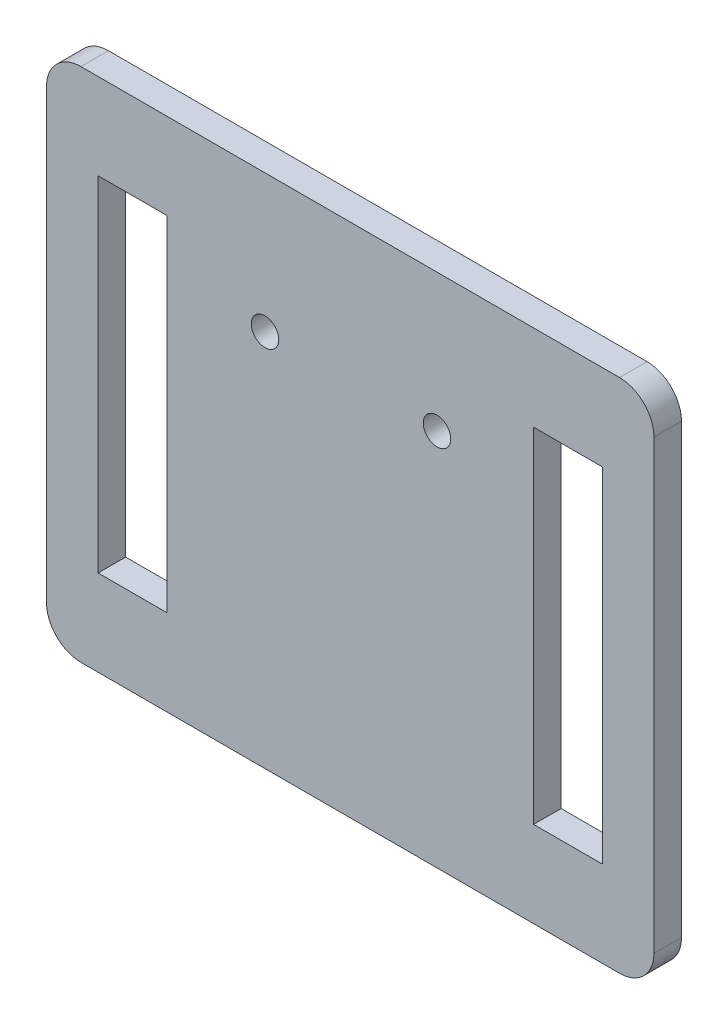
ISO-10303-21;
HEADER;
FILE_DESCRIPTION(('STEP AP214'),'2;1');
FILE_NAME('part.step','',(''),(''),'','','');
FILE_SCHEMA(('AUTOMOTIVE_DESIGN { 1 0 10303 214 1 1 1 1 }'));
ENDSEC;
DATA;
#1=APPLICATION_CONTEXT('core data for automotive mechanical design processes');
#2=APPLICATION_PROTOCOL_DEFINITION('international standard','automotive_design',2000,#1);
#3=PRODUCT_CONTEXT('',#1,'mechanical');
#4=PRODUCT('Part','Part','',(#3));
#5=PRODUCT_RELATED_PRODUCT_CATEGORY('part','',(#4));
#6=PRODUCT_DEFINITION_FORMATION('','',#4);
#7=PRODUCT_DEFINITION_CONTEXT('part definition',#1,'design');
#8=PRODUCT_DEFINITION('design','',#6,#7);
#9=PRODUCT_DEFINITION_SHAPE('','',#8);
#10=(LENGTH_UNIT() NAMED_UNIT(*) SI_UNIT(.MILLI.,.METRE.));
#11=(NAMED_UNIT(*) PLANE_ANGLE_UNIT() SI_UNIT($,.RADIAN.));
#12=(NAMED_UNIT(*) SI_UNIT($,.STERADIAN.) SOLID_ANGLE_UNIT());
#13=UNCERTAINTY_MEASURE_WITH_UNIT(LENGTH_MEASURE(1.E-05),#10,'distance_accuracy_value','');
#14=(GEOMETRIC_REPRESENTATION_CONTEXT(3) GLOBAL_UNCERTAINTY_ASSIGNED_CONTEXT((#13)) GLOBAL_UNIT_ASSIGNED_CONTEXT((#10,
#11,#12)) REPRESENTATION_CONTEXT('',''));
#15=CARTESIAN_POINT('',(0.,0.,0.));
#16=DIRECTION('',(0.,0.,1.));
#17=DIRECTION('',(1.,0.,0.));
#18=AXIS2_PLACEMENT_3D('',#15,#16,#17);
#19=CARTESIAN_POINT('',(0.,6.50000000000001,1.6));
#20=DIRECTION('',(0.,1.,0.));
#21=DIRECTION('',(-1.,0.,0.));
#22=AXIS2_PLACEMENT_3D('',#19,#20,#21);
#23=PLANE('',#22);
#24=DIRECTION('',(1.,0.,0.));
#25=VECTOR('',#24,1.);
#26=CARTESIAN_POINT('',(0.,6.50000000000001,0.));
#27=LINE('',#26,#25);
#28=CARTESIAN_POINT('',(30.,6.5,0.));
#29=VERTEX_POINT('',#28);
#30=CARTESIAN_POINT('',(34.,6.5,0.));
#31=VERTEX_POINT('',#30);
#32=EDGE_CURVE('E239',#29,#31,#27,.T.);
#33=ORIENTED_EDGE('',*,*,#32,.T.);
#34=DIRECTION('',(0.,0.,-1.));
#35=VECTOR('',#34,1.);
#36=CARTESIAN_POINT('',(34.,6.5,1.6));
#37=LINE('',#36,#35);
#38=CARTESIAN_POINT('',(34.,6.5,1.6));
#39=VERTEX_POINT('',#38);
#40=EDGE_CURVE('E185',#39,#31,#37,.T.);
#41=ORIENTED_EDGE('',*,*,#40,.F.);
#42=DIRECTION('',(1.,0.,0.));
#43=VECTOR('',#42,1.);
#44=CARTESIAN_POINT('',(0.,6.50000000000001,1.6));
#45=LINE('',#44,#43);
#46=CARTESIAN_POINT('',(30.,6.5,1.6));
#47=VERTEX_POINT('',#46);
#48=EDGE_CURVE('E290',#47,#39,#45,.T.);
#49=ORIENTED_EDGE('',*,*,#48,.F.);
#50=DIRECTION('',(0.,0.,-1.));
#51=VECTOR('',#50,1.);
#52=CARTESIAN_POINT('',(30.,6.5,1.6));
#53=LINE('',#52,#51);
#54=EDGE_CURVE('E174',#47,#29,#53,.T.);
#55=ORIENTED_EDGE('',*,*,#54,.T.);
#56=EDGE_LOOP('',(#33,#41,#49,#55));
#57=FACE_BOUND('',#56,.T.);
#58=ADVANCED_FACE('F35',(#57),#23,.F.);
#59=CARTESIAN_POINT('',(34.,0.,1.6));
#60=DIRECTION('',(1.,0.,0.));
#61=DIRECTION('',(0.,0.,-1.));
#62=AXIS2_PLACEMENT_3D('',#59,#60,#61);
#63=PLANE('',#62);
#64=DIRECTION('',(0.,-1.,0.));
#65=VECTOR('',#64,1.);
#66=CARTESIAN_POINT('',(34.,0.,0.));
#67=LINE('',#66,#65);
#68=CARTESIAN_POINT('',(34.,-13.5,0.));
#69=VERTEX_POINT('',#68);
#70=EDGE_CURVE('E242',#31,#69,#67,.T.);
#71=ORIENTED_EDGE('',*,*,#70,.T.);
#72=DIRECTION('',(0.,0.,-1.));
#73=VECTOR('',#72,1.);
#74=CARTESIAN_POINT('',(34.,-13.5,1.6));
#75=LINE('',#74,#73);
#76=CARTESIAN_POINT('',(34.,-13.5,1.6));
#77=VERTEX_POINT('',#76);
#78=EDGE_CURVE('E253',#77,#69,#75,.T.);
#79=ORIENTED_EDGE('',*,*,#78,.F.);
#80=DIRECTION('',(0.,-1.,0.));
#81=VECTOR('',#80,1.);
#82=CARTESIAN_POINT('',(34.,0.,1.6));
#83=LINE('',#82,#81);
#84=EDGE_CURVE('E288',#39,#77,#83,.T.);
#85=ORIENTED_EDGE('',*,*,#84,.F.);
#86=ORIENTED_EDGE('',*,*,#40,.T.);
#87=EDGE_LOOP('',(#71,#79,#85,#86));
#88=FACE_BOUND('',#87,.T.);
#89=ADVANCED_FACE('F287',(#88),#63,.F.);
#90=CARTESIAN_POINT('',(0.,-13.5,1.6));
#91=DIRECTION('',(0.,1.,0.));
#92=DIRECTION('',(0.,0.,1.));
#93=AXIS2_PLACEMENT_3D('',#90,#91,#92);
#94=PLANE('',#93);
#95=DIRECTION('',(1.,0.,0.));
#96=VECTOR('',#95,1.);
#97=CARTESIAN_POINT('',(0.,-13.5,0.));
#98=LINE('',#97,#96);
#99=CARTESIAN_POINT('',(30.,-13.5,0.));
#100=VERTEX_POINT('',#99);
#101=EDGE_CURVE('E245',#100,#69,#98,.T.);
#102=ORIENTED_EDGE('',*,*,#101,.F.);
#103=DIRECTION('',(0.,0.,-1.));
#104=VECTOR('',#103,1.);
#105=CARTESIAN_POINT('',(30.,-13.5,1.6));
#106=LINE('',#105,#104);
#107=CARTESIAN_POINT('',(30.,-13.5,1.6));
#108=VERTEX_POINT('',#107);
#109=EDGE_CURVE('E176',#108,#100,#106,.T.);
#110=ORIENTED_EDGE('',*,*,#109,.F.);
#111=DIRECTION('',(1.,0.,0.));
#112=VECTOR('',#111,1.);
#113=CARTESIAN_POINT('',(0.,-13.5,1.6));
#114=LINE('',#113,#112);
#115=EDGE_CURVE('E285',#108,#77,#114,.T.);
#116=ORIENTED_EDGE('',*,*,#115,.T.);
#117=ORIENTED_EDGE('',*,*,#78,.T.);
#118=EDGE_LOOP('',(#102,#110,#116,#117));
#119=FACE_BOUND('',#118,.T.);
#120=ADVANCED_FACE('F283',(#119),#94,.T.);
#121=CARTESIAN_POINT('',(0.,6.5,1.6));
#122=DIRECTION('',(0.,1.,0.));
#123=DIRECTION('',(0.,0.,1.));
#124=AXIS2_PLACEMENT_3D('',#121,#122,#123);
#125=PLANE('',#124);
#126=DIRECTION('',(1.,0.,0.));
#127=VECTOR('',#126,1.);
#128=CARTESIAN_POINT('',(0.,6.5,0.));
#129=LINE('',#128,#127);
#130=CARTESIAN_POINT('',(4.681875,6.5,0.));
#131=VERTEX_POINT('',#130);
#132=CARTESIAN_POINT('',(8.681875,6.5,0.));
#133=VERTEX_POINT('',#132);
#134=EDGE_CURVE('E173',#131,#133,#129,.T.);
#135=ORIENTED_EDGE('',*,*,#134,.T.);
#136=DIRECTION('',(0.,0.,-1.));
#137=VECTOR('',#136,1.);
#138=CARTESIAN_POINT('',(8.681875,6.5,1.6));
#139=LINE('',#138,#137);
#140=CARTESIAN_POINT('',(8.681875,6.5,1.6));
#141=VERTEX_POINT('',#140);
#142=EDGE_CURVE('E153',#141,#133,#139,.T.);
#143=ORIENTED_EDGE('',*,*,#142,.F.);
#144=DIRECTION('',(1.,0.,0.));
#145=VECTOR('',#144,1.);
#146=CARTESIAN_POINT('',(0.,6.5,1.6));
#147=LINE('',#146,#145);
#148=CARTESIAN_POINT('',(4.681875,6.5,1.6));
#149=VERTEX_POINT('',#148);
#150=EDGE_CURVE('E160',#149,#141,#147,.T.);
#151=ORIENTED_EDGE('',*,*,#150,.F.);
#152=DIRECTION('',(0.,0.,-1.));
#153=VECTOR('',#152,1.);
#154=CARTESIAN_POINT('',(4.681875,6.5,1.6));
#155=LINE('',#154,#153);
#156=EDGE_CURVE('E257',#149,#131,#155,.T.);
#157=ORIENTED_EDGE('',*,*,#156,.T.);
#158=EDGE_LOOP('',(#135,#143,#151,#157));
#159=FACE_BOUND('',#158,.T.);
#160=ADVANCED_FACE('F171',(#159),#125,.F.);
#161=CARTESIAN_POINT('',(8.681875,0.,1.6));
#162=DIRECTION('',(1.,0.,0.));
#163=DIRECTION('',(0.,1.,0.));
#164=AXIS2_PLACEMENT_3D('',#161,#162,#163);
#165=PLANE('',#164);
#166=DIRECTION('',(0.,-1.,0.));
#167=VECTOR('',#166,1.);
#168=CARTESIAN_POINT('',(8.681875,0.,0.));
#169=LINE('',#168,#167);
#170=CARTESIAN_POINT('',(8.681875,-13.5,0.));
#171=VERTEX_POINT('',#170);
#172=EDGE_CURVE('E226',#133,#171,#169,.T.);
#173=ORIENTED_EDGE('',*,*,#172,.T.);
#174=DIRECTION('',(0.,0.,-1.));
#175=VECTOR('',#174,1.);
#176=CARTESIAN_POINT('',(8.681875,-13.5,1.6));
#177=LINE('',#176,#175);
#178=CARTESIAN_POINT('',(8.681875,-13.5,1.6));
#179=VERTEX_POINT('',#178);
#180=EDGE_CURVE('E155',#179,#171,#177,.T.);
#181=ORIENTED_EDGE('',*,*,#180,.F.);
#182=DIRECTION('',(0.,-1.,0.));
#183=VECTOR('',#182,1.);
#184=CARTESIAN_POINT('',(8.681875,0.,1.6));
#185=LINE('',#184,#183);
#186=EDGE_CURVE('E148',#141,#179,#185,.T.);
#187=ORIENTED_EDGE('',*,*,#186,.F.);
#188=ORIENTED_EDGE('',*,*,#142,.T.);
#189=EDGE_LOOP('',(#173,#181,#187,#188));
#190=FACE_BOUND('',#189,.T.);
#191=ADVANCED_FACE('F151',(#190),#165,.F.);
#192=CARTESIAN_POINT('',(0.,-13.5,1.6));
#193=DIRECTION('',(0.,1.,0.));
#194=DIRECTION('',(0.,0.,1.));
#195=AXIS2_PLACEMENT_3D('',#192,#193,#194);
#196=PLANE('',#195);
#197=DIRECTION('',(1.,0.,0.));
#198=VECTOR('',#197,1.);
#199=CARTESIAN_POINT('',(0.,-13.5,0.));
#200=LINE('',#199,#198);
#201=CARTESIAN_POINT('',(4.681875,-13.5,0.));
#202=VERTEX_POINT('',#201);
#203=EDGE_CURVE('E233',#202,#171,#200,.T.);
#204=ORIENTED_EDGE('',*,*,#203,.F.);
#205=DIRECTION('',(0.,0.,-1.));
#206=VECTOR('',#205,1.);
#207=CARTESIAN_POINT('',(4.681875,-13.5,1.6));
#208=LINE('',#207,#206);
#209=CARTESIAN_POINT('',(4.681875,-13.5,1.6));
#210=VERTEX_POINT('',#209);
#211=EDGE_CURVE('E178',#210,#202,#208,.T.);
#212=ORIENTED_EDGE('',*,*,#211,.F.);
#213=DIRECTION('',(1.,0.,0.));
#214=VECTOR('',#213,1.);
#215=CARTESIAN_POINT('',(0.,-13.5,1.6));
#216=LINE('',#215,#214);
#217=EDGE_CURVE('E159',#210,#179,#216,.T.);
#218=ORIENTED_EDGE('',*,*,#217,.T.);
#219=ORIENTED_EDGE('',*,*,#180,.T.);
#220=EDGE_LOOP('',(#204,#212,#218,#219));
#221=FACE_BOUND('',#220,.T.);
#222=ADVANCED_FACE('F264',(#221),#196,.T.);
#223=CARTESIAN_POINT('',(1.681875,0.,1.6));
#224=DIRECTION('',(1.,0.,0.));
#225=DIRECTION('',(0.,1.,0.));
#226=AXIS2_PLACEMENT_3D('',#223,#224,#225);
#227=PLANE('',#226);
#228=DIRECTION('',(0.,-1.,0.));
#229=VECTOR('',#228,1.);
#230=CARTESIAN_POINT('',(1.681875,0.,0.));
#231=LINE('',#230,#229);
#232=CARTESIAN_POINT('',(1.681875,9.5,0.));
#233=VERTEX_POINT('',#232);
#234=CARTESIAN_POINT('',(1.681875,-16.5,0.));
#235=VERTEX_POINT('',#234);
#236=EDGE_CURVE('E302',#233,#235,#231,.T.);
#237=ORIENTED_EDGE('',*,*,#236,.T.);
#238=DIRECTION('',(0.,0.,-1.));
#239=VECTOR('',#238,1.);
#240=CARTESIAN_POINT('',(1.681875,-16.5,1.6));
#241=LINE('',#240,#239);
#242=CARTESIAN_POINT('',(1.681875,-16.5,1.6));
#243=VERTEX_POINT('',#242);
#244=EDGE_CURVE('E211',#235,#243,#241,.F.);
#245=ORIENTED_EDGE('',*,*,#244,.T.);
#246=DIRECTION('',(0.,-1.,0.));
#247=VECTOR('',#246,1.);
#248=CARTESIAN_POINT('',(1.681875,0.,1.6));
#249=LINE('',#248,#247);
#250=CARTESIAN_POINT('',(1.681875,9.5,1.6));
#251=VERTEX_POINT('',#250);
#252=EDGE_CURVE('E323',#251,#243,#249,.T.);
#253=ORIENTED_EDGE('',*,*,#252,.F.);
#254=DIRECTION('',(0.,0.,-1.));
#255=VECTOR('',#254,1.);
#256=CARTESIAN_POINT('',(1.681875,9.5,0.));
#257=LINE('',#256,#255);
#258=EDGE_CURVE('E208',#251,#233,#257,.T.);
#259=ORIENTED_EDGE('',*,*,#258,.T.);
#260=EDGE_LOOP('',(#237,#245,#253,#259));
#261=FACE_BOUND('',#260,.T.);
#262=ADVANCED_FACE('F369',(#261),#227,.F.);
#263=CARTESIAN_POINT('',(0.,-18.5,1.6));
#264=DIRECTION('',(0.,1.,0.));
#265=DIRECTION('',(0.,0.,1.));
#266=AXIS2_PLACEMENT_3D('',#263,#264,#265);
#267=PLANE('',#266);
#268=DIRECTION('',(1.,0.,0.));
#269=VECTOR('',#268,1.);
#270=CARTESIAN_POINT('',(0.,-18.5,0.));
#271=LINE('',#270,#269);
#272=CARTESIAN_POINT('',(3.681875,-18.5,0.));
#273=VERTEX_POINT('',#272);
#274=CARTESIAN_POINT('',(35.,-18.5,0.));
#275=VERTEX_POINT('',#274);
#276=EDGE_CURVE('E228',#273,#275,#271,.T.);
#277=ORIENTED_EDGE('',*,*,#276,.T.);
#278=DIRECTION('',(0.,0.,-1.));
#279=VECTOR('',#278,1.);
#280=CARTESIAN_POINT('',(35.,-18.5,1.6));
#281=LINE('',#280,#279);
#282=CARTESIAN_POINT('',(35.,-18.5,1.6));
#283=VERTEX_POINT('',#282);
#284=EDGE_CURVE('E199',#275,#283,#281,.F.);
#285=ORIENTED_EDGE('',*,*,#284,.T.);
#286=DIRECTION('',(1.,0.,0.));
#287=VECTOR('',#286,1.);
#288=CARTESIAN_POINT('',(0.,-18.5,1.6));
#289=LINE('',#288,#287);
#290=CARTESIAN_POINT('',(3.681875,-18.5,1.6));
#291=VERTEX_POINT('',#290);
#292=EDGE_CURVE('E317',#291,#283,#289,.T.);
#293=ORIENTED_EDGE('',*,*,#292,.F.);
#294=DIRECTION('',(0.,0.,-1.));
#295=VECTOR('',#294,1.);
#296=CARTESIAN_POINT('',(3.681875,-18.5,1.6));
#297=LINE('',#296,#295);
#298=EDGE_CURVE('E196',#291,#273,#297,.T.);
#299=ORIENTED_EDGE('',*,*,#298,.T.);
#300=EDGE_LOOP('',(#277,#285,#293,#299));
#301=FACE_BOUND('',#300,.T.);
#302=ADVANCED_FACE('F308',(#301),#267,.F.);
#303=CARTESIAN_POINT('',(37.,0.,1.6));
#304=DIRECTION('',(1.,0.,0.));
#305=DIRECTION('',(0.,0.,-1.));
#306=AXIS2_PLACEMENT_3D('',#303,#304,#305);
#307=PLANE('',#306);
#308=DIRECTION('',(0.,-1.,0.));
#309=VECTOR('',#308,1.);
#310=CARTESIAN_POINT('',(37.,0.,1.6));
#311=LINE('',#310,#309);
#312=CARTESIAN_POINT('',(37.,9.5,1.6));
#313=VERTEX_POINT('',#312);
#314=CARTESIAN_POINT('',(37.,-16.5,1.6));
#315=VERTEX_POINT('',#314);
#316=EDGE_CURVE('E316',#313,#315,#311,.T.);
#317=ORIENTED_EDGE('',*,*,#316,.T.);
#318=DIRECTION('',(0.,0.,-1.));
#319=VECTOR('',#318,1.);
#320=CARTESIAN_POINT('',(37.,-16.5,0.));
#321=LINE('',#320,#319);
#322=CARTESIAN_POINT('',(37.,-16.5,0.));
#323=VERTEX_POINT('',#322);
#324=EDGE_CURVE('E184',#315,#323,#321,.T.);
#325=ORIENTED_EDGE('',*,*,#324,.T.);
#326=DIRECTION('',(0.,-1.,0.));
#327=VECTOR('',#326,1.);
#328=CARTESIAN_POINT('',(37.,0.,0.));
#329=LINE('',#328,#327);
#330=CARTESIAN_POINT('',(37.,9.5,0.));
#331=VERTEX_POINT('',#330);
#332=EDGE_CURVE('E224',#331,#323,#329,.T.);
#333=ORIENTED_EDGE('',*,*,#332,.F.);
#334=DIRECTION('',(0.,0.,-1.));
#335=VECTOR('',#334,1.);
#336=CARTESIAN_POINT('',(37.,9.5,1.6));
#337=LINE('',#336,#335);
#338=EDGE_CURVE('E182',#331,#313,#337,.F.);
#339=ORIENTED_EDGE('',*,*,#338,.T.);
#340=EDGE_LOOP('',(#317,#325,#333,#339));
#341=FACE_BOUND('',#340,.T.);
#342=ADVANCED_FACE('F319',(#341),#307,.T.);
#343=CARTESIAN_POINT('',(4.681875,0.,1.6));
#344=DIRECTION('',(1.,0.,0.));
#345=DIRECTION('',(0.,1.,0.));
#346=AXIS2_PLACEMENT_3D('',#343,#344,#345);
#347=PLANE('',#346);
#348=DIRECTION('',(0.,-1.,0.));
#349=VECTOR('',#348,1.);
#350=CARTESIAN_POINT('',(4.681875,0.,0.));
#351=LINE('',#350,#349);
#352=EDGE_CURVE('E236',#131,#202,#351,.T.);
#353=ORIENTED_EDGE('',*,*,#352,.F.);
#354=ORIENTED_EDGE('',*,*,#156,.F.);
#355=DIRECTION('',(0.,-1.,0.));
#356=VECTOR('',#355,1.);
#357=CARTESIAN_POINT('',(4.681875,0.,1.6));
#358=LINE('',#357,#356);
#359=EDGE_CURVE('E167',#149,#210,#358,.T.);
#360=ORIENTED_EDGE('',*,*,#359,.T.);
#361=ORIENTED_EDGE('',*,*,#211,.T.);
#362=EDGE_LOOP('',(#353,#354,#360,#361));
#363=FACE_BOUND('',#362,.T.);
#364=ADVANCED_FACE('F262',(#363),#347,.T.);
#365=CARTESIAN_POINT('',(0.,11.5,1.6));
#366=DIRECTION('',(0.,1.,0.));
#367=DIRECTION('',(0.,0.,1.));
#368=AXIS2_PLACEMENT_3D('',#365,#366,#367);
#369=PLANE('',#368);
#370=DIRECTION('',(1.,0.,0.));
#371=VECTOR('',#370,1.);
#372=CARTESIAN_POINT('',(0.,11.5,0.));
#373=LINE('',#372,#371);
#374=CARTESIAN_POINT('',(3.681875,11.5,0.));
#375=VERTEX_POINT('',#374);
#376=CARTESIAN_POINT('',(35.,11.5,0.));
#377=VERTEX_POINT('',#376);
#378=EDGE_CURVE('E216',#375,#377,#373,.T.);
#379=ORIENTED_EDGE('',*,*,#378,.F.);
#380=DIRECTION('',(0.,0.,-1.));
#381=VECTOR('',#380,1.);
#382=CARTESIAN_POINT('',(3.681875,11.5,1.6));
#383=LINE('',#382,#381);
#384=CARTESIAN_POINT('',(3.681875,11.5,1.6));
#385=VERTEX_POINT('',#384);
#386=EDGE_CURVE('E11',#375,#385,#383,.F.);
#387=ORIENTED_EDGE('',*,*,#386,.T.);
#388=DIRECTION('',(1.,0.,0.));
#389=VECTOR('',#388,1.);
#390=CARTESIAN_POINT('',(0.,11.5,1.6));
#391=LINE('',#390,#389);
#392=CARTESIAN_POINT('',(35.,11.5,1.6));
#393=VERTEX_POINT('',#392);
#394=EDGE_CURVE('E169',#385,#393,#391,.T.);
#395=ORIENTED_EDGE('',*,*,#394,.T.);
#396=DIRECTION('',(0.,0.,-1.));
#397=VECTOR('',#396,1.);
#398=CARTESIAN_POINT('',(35.,11.5,1.6));
#399=LINE('',#398,#397);
#400=EDGE_CURVE('E43',#393,#377,#399,.T.);
#401=ORIENTED_EDGE('',*,*,#400,.T.);
#402=EDGE_LOOP('',(#379,#387,#395,#401));
#403=FACE_BOUND('',#402,.T.);
#404=ADVANCED_FACE('F215',(#403),#369,.T.);
#405=CARTESIAN_POINT('',(14.38454247981,3.5,1.6));
#406=DIRECTION('',(0.,0.,-1.));
#407=DIRECTION('',(-1.,0.,0.));
#408=AXIS2_PLACEMENT_3D('',#405,#406,#407);
#409=CYLINDRICAL_SURFACE('',#408,0.800000000000001);
#410=CARTESIAN_POINT('',(14.38454247981,3.5,1.6));
#411=DIRECTION('',(0.,0.,1.));
#412=DIRECTION('',(1.,0.,0.));
#413=AXIS2_PLACEMENT_3D('',#410,#411,#412);
#414=CIRCLE('',#413,0.800000000000001);
#415=CARTESIAN_POINT('',(15.18454247981,3.5,1.6));
#416=VERTEX_POINT('',#415);
#417=EDGE_CURVE('E330',#416,#416,#414,.T.);
#418=ORIENTED_EDGE('',*,*,#417,.T.);
#419=EDGE_LOOP('',(#418));
#420=FACE_BOUND('',#419,.T.);
#421=CARTESIAN_POINT('',(14.38454247981,3.5,0.));
#422=DIRECTION('',(0.,0.,1.));
#423=DIRECTION('',(1.,0.,0.));
#424=AXIS2_PLACEMENT_3D('',#421,#422,#423);
#425=CIRCLE('',#424,0.800000000000001);
#426=CARTESIAN_POINT('',(15.18454247981,3.5,0.));
#427=VERTEX_POINT('',#426);
#428=EDGE_CURVE('E299',#427,#427,#425,.T.);
#429=ORIENTED_EDGE('',*,*,#428,.F.);
#430=EDGE_LOOP('',(#429));
#431=FACE_BOUND('',#430,.T.);
#432=ADVANCED_FACE('F344',(#420,#431),#409,.F.);
#433=CARTESIAN_POINT('',(24.38454247981,3.5,1.6));
#434=DIRECTION('',(0.,0.,-1.));
#435=DIRECTION('',(-1.,0.,0.));
#436=AXIS2_PLACEMENT_3D('',#433,#434,#435);
#437=CYLINDRICAL_SURFACE('',#436,0.799999999999999);
#438=CARTESIAN_POINT('',(24.38454247981,3.5,1.6));
#439=DIRECTION('',(0.,0.,1.));
#440=DIRECTION('',(1.,0.,0.));
#441=AXIS2_PLACEMENT_3D('',#438,#439,#440);
#442=CIRCLE('',#441,0.799999999999999);
#443=CARTESIAN_POINT('',(25.18454247981,3.5,1.6));
#444=VERTEX_POINT('',#443);
#445=EDGE_CURVE('E250',#444,#444,#442,.T.);
#446=ORIENTED_EDGE('',*,*,#445,.T.);
#447=EDGE_LOOP('',(#446));
#448=FACE_BOUND('',#447,.T.);
#449=CARTESIAN_POINT('',(24.38454247981,3.5,0.));
#450=DIRECTION('',(0.,0.,1.));
#451=DIRECTION('',(1.,0.,0.));
#452=AXIS2_PLACEMENT_3D('',#449,#450,#451);
#453=CIRCLE('',#452,0.799999999999999);
#454=CARTESIAN_POINT('',(25.18454247981,3.5,0.));
#455=VERTEX_POINT('',#454);
#456=EDGE_CURVE('E296',#455,#455,#453,.T.);
#457=ORIENTED_EDGE('',*,*,#456,.F.);
#458=EDGE_LOOP('',(#457));
#459=FACE_BOUND('',#458,.T.);
#460=ADVANCED_FACE('F336',(#448,#459),#437,.F.);
#461=CARTESIAN_POINT('',(30.,0.,1.6));
#462=DIRECTION('',(1.,0.,0.));
#463=DIRECTION('',(0.,0.,-1.));
#464=AXIS2_PLACEMENT_3D('',#461,#462,#463);
#465=PLANE('',#464);
#466=DIRECTION('',(0.,-1.,0.));
#467=VECTOR('',#466,1.);
#468=CARTESIAN_POINT('',(30.,0.,0.));
#469=LINE('',#468,#467);
#470=EDGE_CURVE('E248',#29,#100,#469,.T.);
#471=ORIENTED_EDGE('',*,*,#470,.F.);
#472=ORIENTED_EDGE('',*,*,#54,.F.);
#473=DIRECTION('',(0.,-1.,0.));
#474=VECTOR('',#473,1.);
#475=CARTESIAN_POINT('',(30.,0.,1.6));
#476=LINE('',#475,#474);
#477=EDGE_CURVE('E258',#47,#108,#476,.T.);
#478=ORIENTED_EDGE('',*,*,#477,.T.);
#479=ORIENTED_EDGE('',*,*,#109,.T.);
#480=EDGE_LOOP('',(#471,#472,#478,#479));
#481=FACE_BOUND('',#480,.T.);
#482=ADVANCED_FACE('F275',(#481),#465,.T.);
#483=CARTESIAN_POINT('',(0.,0.,1.6));
#484=DIRECTION('',(0.,0.,1.));
#485=DIRECTION('',(1.,0.,0.));
#486=AXIS2_PLACEMENT_3D('',#483,#484,#485);
#487=PLANE('',#486);
#488=ORIENTED_EDGE('',*,*,#445,.F.);
#489=EDGE_LOOP('',(#488));
#490=FACE_BOUND('',#489,.T.);
#491=ORIENTED_EDGE('',*,*,#417,.F.);
#492=EDGE_LOOP('',(#491));
#493=FACE_BOUND('',#492,.T.);
#494=ORIENTED_EDGE('',*,*,#292,.T.);
#495=CARTESIAN_POINT('',(35.,-16.5,1.6));
#496=DIRECTION('',(0.,0.,1.));
#497=DIRECTION('',(1.,0.,0.));
#498=AXIS2_PLACEMENT_3D('',#495,#496,#497);
#499=CIRCLE('',#498,2.);
#500=EDGE_CURVE('E206',#283,#315,#499,.T.);
#501=ORIENTED_EDGE('',*,*,#500,.T.);
#502=ORIENTED_EDGE('',*,*,#316,.F.);
#503=CARTESIAN_POINT('',(35.,9.5,1.6));
#504=DIRECTION('',(0.,0.,1.));
#505=DIRECTION('',(1.,0.,0.));
#506=AXIS2_PLACEMENT_3D('',#503,#504,#505);
#507=CIRCLE('',#506,2.);
#508=EDGE_CURVE('E50',#313,#393,#507,.T.);
#509=ORIENTED_EDGE('',*,*,#508,.T.);
#510=ORIENTED_EDGE('',*,*,#394,.F.);
#511=CARTESIAN_POINT('',(3.681875,9.5,1.6));
#512=DIRECTION('',(0.,0.,1.));
#513=DIRECTION('',(1.,0.,0.));
#514=AXIS2_PLACEMENT_3D('',#511,#512,#513);
#515=CIRCLE('',#514,2.);
#516=EDGE_CURVE('E202',#385,#251,#515,.T.);
#517=ORIENTED_EDGE('',*,*,#516,.T.);
#518=ORIENTED_EDGE('',*,*,#252,.T.);
#519=CARTESIAN_POINT('',(3.681875,-16.5,1.6));
#520=DIRECTION('',(0.,0.,1.));
#521=DIRECTION('',(1.,0.,0.));
#522=AXIS2_PLACEMENT_3D('',#519,#520,#521);
#523=CIRCLE('',#522,2.);
#524=EDGE_CURVE('E204',#243,#291,#523,.T.);
#525=ORIENTED_EDGE('',*,*,#524,.T.);
#526=EDGE_LOOP('',(#494,#501,#502,#509,#510,#517,#518,#525));
#527=FACE_BOUND('',#526,.T.);
#528=ORIENTED_EDGE('',*,*,#150,.T.);
#529=ORIENTED_EDGE('',*,*,#186,.T.);
#530=ORIENTED_EDGE('',*,*,#217,.F.);
#531=ORIENTED_EDGE('',*,*,#359,.F.);
#532=EDGE_LOOP('',(#528,#529,#530,#531));
#533=FACE_BOUND('',#532,.T.);
#534=ORIENTED_EDGE('',*,*,#48,.T.);
#535=ORIENTED_EDGE('',*,*,#84,.T.);
#536=ORIENTED_EDGE('',*,*,#115,.F.);
#537=ORIENTED_EDGE('',*,*,#477,.F.);
#538=EDGE_LOOP('',(#534,#535,#536,#537));
#539=FACE_BOUND('',#538,.T.);
#540=ADVANCED_FACE('F164',(#490,#493,#527,#533,#539),#487,.T.);
#541=CARTESIAN_POINT('',(0.,0.,0.));
#542=DIRECTION('',(0.,0.,1.));
#543=DIRECTION('',(1.,0.,0.));
#544=AXIS2_PLACEMENT_3D('',#541,#542,#543);
#545=PLANE('',#544);
#546=ORIENTED_EDGE('',*,*,#456,.T.);
#547=EDGE_LOOP('',(#546));
#548=FACE_BOUND('',#547,.T.);
#549=ORIENTED_EDGE('',*,*,#428,.T.);
#550=EDGE_LOOP('',(#549));
#551=FACE_BOUND('',#550,.T.);
#552=ORIENTED_EDGE('',*,*,#332,.T.);
#553=CARTESIAN_POINT('',(35.,-16.5,0.));
#554=DIRECTION('',(0.,0.,1.));
#555=DIRECTION('',(1.,0.,0.));
#556=AXIS2_PLACEMENT_3D('',#553,#554,#555);
#557=CIRCLE('',#556,2.);
#558=EDGE_CURVE('E194',#323,#275,#557,.F.);
#559=ORIENTED_EDGE('',*,*,#558,.T.);
#560=ORIENTED_EDGE('',*,*,#276,.F.);
#561=CARTESIAN_POINT('',(3.681875,-16.5,0.));
#562=DIRECTION('',(0.,0.,1.));
#563=DIRECTION('',(1.,0.,0.));
#564=AXIS2_PLACEMENT_3D('',#561,#562,#563);
#565=CIRCLE('',#564,2.);
#566=EDGE_CURVE('E192',#273,#235,#565,.F.);
#567=ORIENTED_EDGE('',*,*,#566,.T.);
#568=ORIENTED_EDGE('',*,*,#236,.F.);
#569=CARTESIAN_POINT('',(3.681875,9.5,0.));
#570=DIRECTION('',(0.,0.,1.));
#571=DIRECTION('',(1.,0.,0.));
#572=AXIS2_PLACEMENT_3D('',#569,#570,#571);
#573=CIRCLE('',#572,2.);
#574=EDGE_CURVE('E190',#233,#375,#573,.F.);
#575=ORIENTED_EDGE('',*,*,#574,.T.);
#576=ORIENTED_EDGE('',*,*,#378,.T.);
#577=CARTESIAN_POINT('',(35.,9.5,0.));
#578=DIRECTION('',(0.,0.,1.));
#579=DIRECTION('',(1.,0.,0.));
#580=AXIS2_PLACEMENT_3D('',#577,#578,#579);
#581=CIRCLE('',#580,2.);
#582=EDGE_CURVE('E188',#377,#331,#581,.F.);
#583=ORIENTED_EDGE('',*,*,#582,.T.);
#584=EDGE_LOOP('',(#552,#559,#560,#567,#568,#575,#576,#583));
#585=FACE_BOUND('',#584,.T.);
#586=ORIENTED_EDGE('',*,*,#134,.F.);
#587=ORIENTED_EDGE('',*,*,#352,.T.);
#588=ORIENTED_EDGE('',*,*,#203,.T.);
#589=ORIENTED_EDGE('',*,*,#172,.F.);
#590=EDGE_LOOP('',(#586,#587,#588,#589));
#591=FACE_BOUND('',#590,.T.);
#592=ORIENTED_EDGE('',*,*,#32,.F.);
#593=ORIENTED_EDGE('',*,*,#470,.T.);
#594=ORIENTED_EDGE('',*,*,#101,.T.);
#595=ORIENTED_EDGE('',*,*,#70,.F.);
#596=EDGE_LOOP('',(#592,#593,#594,#595));
#597=FACE_BOUND('',#596,.T.);
#598=ADVANCED_FACE('F220',(#548,#551,#585,#591,#597),#545,.F.);
#599=CARTESIAN_POINT('',(35.,-16.5,1.6));
#600=DIRECTION('',(0.,0.,1.));
#601=DIRECTION('',(1.,0.,0.));
#602=AXIS2_PLACEMENT_3D('',#599,#600,#601);
#603=CYLINDRICAL_SURFACE('',#602,2.);
#604=ORIENTED_EDGE('',*,*,#500,.F.);
#605=ORIENTED_EDGE('',*,*,#284,.F.);
#606=ORIENTED_EDGE('',*,*,#558,.F.);
#607=ORIENTED_EDGE('',*,*,#324,.F.);
#608=EDGE_LOOP('',(#604,#605,#606,#607));
#609=FACE_BOUND('',#608,.T.);
#610=ADVANCED_FACE('F267',(#609),#603,.T.);
#611=CARTESIAN_POINT('',(3.681875,-16.5,1.6));
#612=DIRECTION('',(0.,0.,-1.));
#613=DIRECTION('',(-1.,0.,0.));
#614=AXIS2_PLACEMENT_3D('',#611,#612,#613);
#615=CYLINDRICAL_SURFACE('',#614,2.);
#616=ORIENTED_EDGE('',*,*,#524,.F.);
#617=ORIENTED_EDGE('',*,*,#244,.F.);
#618=ORIENTED_EDGE('',*,*,#566,.F.);
#619=ORIENTED_EDGE('',*,*,#298,.F.);
#620=EDGE_LOOP('',(#616,#617,#618,#619));
#621=FACE_BOUND('',#620,.T.);
#622=ADVANCED_FACE('F386',(#621),#615,.T.);
#623=CARTESIAN_POINT('',(3.681875,9.5,1.6));
#624=DIRECTION('',(0.,0.,1.));
#625=DIRECTION('',(1.,0.,0.));
#626=AXIS2_PLACEMENT_3D('',#623,#624,#625);
#627=CYLINDRICAL_SURFACE('',#626,2.);
#628=ORIENTED_EDGE('',*,*,#516,.F.);
#629=ORIENTED_EDGE('',*,*,#386,.F.);
#630=ORIENTED_EDGE('',*,*,#574,.F.);
#631=ORIENTED_EDGE('',*,*,#258,.F.);
#632=EDGE_LOOP('',(#628,#629,#630,#631));
#633=FACE_BOUND('',#632,.T.);
#634=ADVANCED_FACE('F389',(#633),#627,.T.);
#635=CARTESIAN_POINT('',(35.,9.5,1.6));
#636=DIRECTION('',(0.,0.,-1.));
#637=DIRECTION('',(-1.,0.,0.));
#638=AXIS2_PLACEMENT_3D('',#635,#636,#637);
#639=CYLINDRICAL_SURFACE('',#638,2.);
#640=ORIENTED_EDGE('',*,*,#508,.F.);
#641=ORIENTED_EDGE('',*,*,#338,.F.);
#642=ORIENTED_EDGE('',*,*,#582,.F.);
#643=ORIENTED_EDGE('',*,*,#400,.F.);
#644=EDGE_LOOP('',(#640,#641,#642,#643));
#645=FACE_BOUND('',#644,.T.);
#646=ADVANCED_FACE('F37',(#645),#639,.T.);
#647=CLOSED_SHELL('',(#58,#89,#120,#160,#191,#222,#262,#302,#342,#364,#404,#432,#460,#482,#540,
#598,#610,#622,#634,#646));
#648=MANIFOLD_SOLID_BREP('B2',#647);
#649=ADVANCED_BREP_SHAPE_REPRESENTATION('',(#18,#648),#14);
#650=SHAPE_DEFINITION_REPRESENTATION(#9,#649);
ENDSEC;
END-ISO-10303-21;
